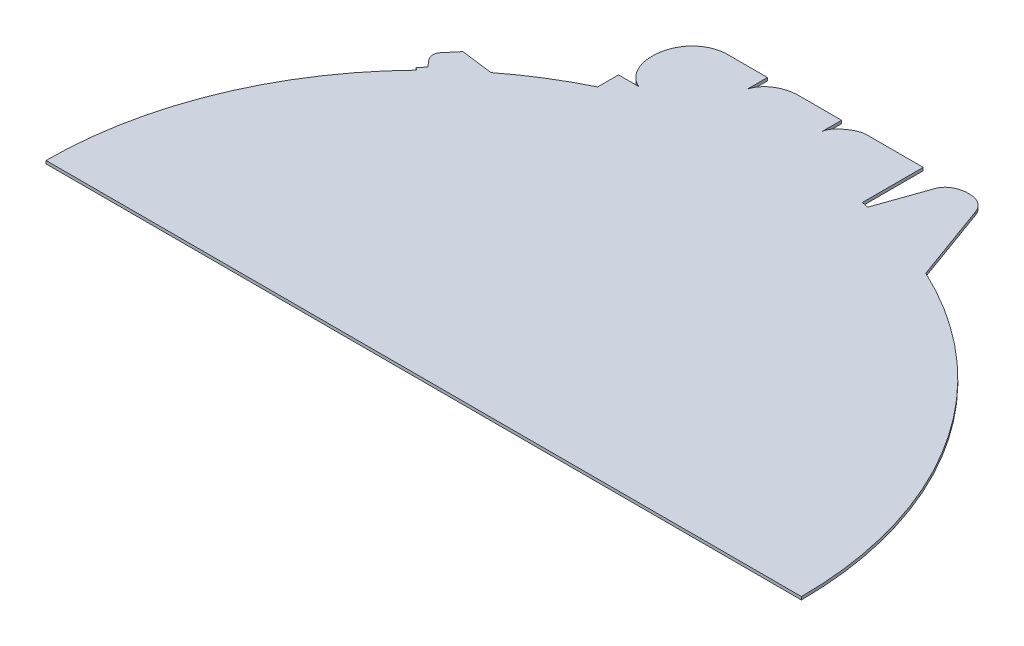
ISO-10303-21;
HEADER;
FILE_DESCRIPTION(('STEP AP214'),'2;1');
FILE_NAME('part.step','',(''),(''),'','','');
FILE_SCHEMA(('AUTOMOTIVE_DESIGN { 1 0 10303 214 1 1 1 1 }'));
ENDSEC;
DATA;
#1=APPLICATION_CONTEXT('core data for automotive mechanical design processes');
#2=APPLICATION_PROTOCOL_DEFINITION('international standard','automotive_design',2000,#1);
#3=PRODUCT_CONTEXT('',#1,'mechanical');
#4=PRODUCT('Part','Part','',(#3));
#5=PRODUCT_RELATED_PRODUCT_CATEGORY('part','',(#4));
#6=PRODUCT_DEFINITION_FORMATION('','',#4);
#7=PRODUCT_DEFINITION_CONTEXT('part definition',#1,'design');
#8=PRODUCT_DEFINITION('design','',#6,#7);
#9=PRODUCT_DEFINITION_SHAPE('','',#8);
#10=(LENGTH_UNIT() NAMED_UNIT(*) SI_UNIT(.MILLI.,.METRE.));
#11=(NAMED_UNIT(*) PLANE_ANGLE_UNIT() SI_UNIT($,.RADIAN.));
#12=(NAMED_UNIT(*) SI_UNIT($,.STERADIAN.) SOLID_ANGLE_UNIT());
#13=UNCERTAINTY_MEASURE_WITH_UNIT(LENGTH_MEASURE(1.E-05),#10,'distance_accuracy_value','');
#14=(GEOMETRIC_REPRESENTATION_CONTEXT(3) GLOBAL_UNCERTAINTY_ASSIGNED_CONTEXT((#13)) GLOBAL_UNIT_ASSIGNED_CONTEXT((#10,
#11,#12)) REPRESENTATION_CONTEXT('',''));
#15=CARTESIAN_POINT('',(0.,0.,0.));
#16=DIRECTION('',(0.,0.,1.));
#17=DIRECTION('',(1.,0.,0.));
#18=AXIS2_PLACEMENT_3D('',#15,#16,#17);
#19=CARTESIAN_POINT('',(61.2417983531615,2.,-137.079482633187));
#20=CARTESIAN_POINT('',(63.470508701976,2.,-142.966505442115));
#21=CARTESIAN_POINT('',(70.6396262263932,2.,-145.565487584388));
#22=CARTESIAN_POINT('',(76.4978494080845,2.,-145.094502844673));
#23=B_SPLINE_CURVE_WITH_KNOTS('',3,(#19,#20,#21,#22),.UNSPECIFIED.,.F.,.F.,(4,4),(0.,1.),.UNSPECIFIED.);
#24=DIRECTION('',(0.,-1.,0.));
#25=VECTOR('',#24,1.);
#26=SURFACE_OF_LINEAR_EXTRUSION('',#23,#25);
#27=CARTESIAN_POINT('',(61.2417983531615,0.,-137.079482633187));
#28=CARTESIAN_POINT('',(63.470508701976,0.,-142.966505442115));
#29=CARTESIAN_POINT('',(70.6396262263932,0.,-145.565487584388));
#30=CARTESIAN_POINT('',(76.4978494080845,0.,-145.094502844673));
#31=B_SPLINE_CURVE_WITH_KNOTS('',3,(#27,#28,#29,#30),.UNSPECIFIED.,.F.,.F.,(4,4),(0.,1.),.UNSPECIFIED.);
#32=CARTESIAN_POINT('',(61.2417983531615,0.,-137.079482633187));
#33=VERTEX_POINT('',#32);
#34=CARTESIAN_POINT('',(73.732714296106,0.,-145.093801448274));
#35=VERTEX_POINT('',#34);
#36=EDGE_CURVE('E242',#33,#35,#31,.T.);
#37=ORIENTED_EDGE('',*,*,#36,.F.);
#38=DIRECTION('',(0.,-1.,0.));
#39=VECTOR('',#38,1.);
#40=CARTESIAN_POINT('',(61.2417983531615,2.,-137.079482633187));
#41=LINE('',#40,#39);
#42=CARTESIAN_POINT('',(61.2417983531615,2.,-137.079482633187));
#43=VERTEX_POINT('',#42);
#44=EDGE_CURVE('E11',#43,#33,#41,.T.);
#45=ORIENTED_EDGE('',*,*,#44,.F.);
#46=CARTESIAN_POINT('',(73.732714296106,2.,-145.093801448274));
#47=VERTEX_POINT('',#46);
#48=EDGE_CURVE('E338',#43,#47,#23,.T.);
#49=ORIENTED_EDGE('',*,*,#48,.T.);
#50=DIRECTION('',(0.,-1.,0.));
#51=VECTOR('',#50,1.);
#52=CARTESIAN_POINT('',(73.732714296106,2.,-145.093801448274));
#53=LINE('',#52,#51);
#54=EDGE_CURVE('E52',#47,#35,#53,.T.);
#55=ORIENTED_EDGE('',*,*,#54,.T.);
#56=EDGE_LOOP('',(#37,#45,#49,#55));
#57=FACE_BOUND('',#56,.T.);
#58=ADVANCED_FACE('F35',(#57),#26,.T.);
#59=CARTESIAN_POINT('',(11.6282593706701,2.,4.08680506508995));
#60=DIRECTION('',(-0.943429676553875,0.,-0.331572684938689));
#61=DIRECTION('',(-0.331572684938689,0.,0.943429676553875));
#62=AXIS2_PLACEMENT_3D('',#59,#60,#61);
#63=PLANE('',#62);
#64=DIRECTION('',(0.331572684938689,0.,-0.943429676553875));
#65=VECTOR('',#64,1.);
#66=CARTESIAN_POINT('',(11.6282593706701,0.,4.08680506508995));
#67=LINE('',#66,#65);
#68=CARTESIAN_POINT('',(49.4033169258323,0.,-103.395240199467));
#69=VERTEX_POINT('',#68);
#70=EDGE_CURVE('E246',#69,#33,#67,.T.);
#71=ORIENTED_EDGE('',*,*,#70,.F.);
#72=DIRECTION('',(0.,-1.,0.));
#73=VECTOR('',#72,1.);
#74=CARTESIAN_POINT('',(49.4033169258323,2.,-103.395240199467));
#75=LINE('',#74,#73);
#76=CARTESIAN_POINT('',(49.4033169258323,2.,-103.395240199467));
#77=VERTEX_POINT('',#76);
#78=EDGE_CURVE('E44',#77,#69,#75,.T.);
#79=ORIENTED_EDGE('',*,*,#78,.F.);
#80=DIRECTION('',(0.331572684938689,0.,-0.943429676553875));
#81=VECTOR('',#80,1.);
#82=CARTESIAN_POINT('',(11.6282593706701,2.,4.08680506508995));
#83=LINE('',#82,#81);
#84=EDGE_CURVE('E406',#77,#43,#83,.T.);
#85=ORIENTED_EDGE('',*,*,#84,.T.);
#86=ORIENTED_EDGE('',*,*,#44,.T.);
#87=EDGE_LOOP('',(#71,#79,#85,#86));
#88=FACE_BOUND('',#87,.T.);
#89=ADVANCED_FACE('F394',(#88),#63,.T.);
#90=CARTESIAN_POINT('',(-0.00210082559104485,2.,145.041993281075));
#91=DIRECTION('',(0.,-1.,0.));
#92=DIRECTION('',(0.,0.,-1.));
#93=AXIS2_PLACEMENT_3D('',#90,#91,#92);
#94=CYLINDRICAL_SURFACE('',#93,253.302100825591);
#95=CARTESIAN_POINT('',(-0.00210082559104485,0.,145.041993281075));
#96=DIRECTION('',(0.,1.,0.));
#97=DIRECTION('',(0.,0.,1.));
#98=AXIS2_PLACEMENT_3D('',#95,#96,#97);
#99=CIRCLE('',#98,253.302100825591);
#100=CARTESIAN_POINT('',(44.8660371290695,0.,-104.254626188864));
#101=VERTEX_POINT('',#100);
#102=EDGE_CURVE('E252',#101,#69,#99,.F.);
#103=ORIENTED_EDGE('',*,*,#102,.F.);
#104=DIRECTION('',(0.,-1.,0.));
#105=VECTOR('',#104,1.);
#106=CARTESIAN_POINT('',(44.8660371290695,2.,-104.254626188864));
#107=LINE('',#106,#105);
#108=CARTESIAN_POINT('',(44.8660371290695,2.,-104.254626188864));
#109=VERTEX_POINT('',#108);
#110=EDGE_CURVE('E383',#109,#101,#107,.T.);
#111=ORIENTED_EDGE('',*,*,#110,.F.);
#112=CARTESIAN_POINT('',(-0.00210082559104485,2.,145.041993281075));
#113=DIRECTION('',(0.,1.,0.));
#114=DIRECTION('',(0.,0.,1.));
#115=AXIS2_PLACEMENT_3D('',#112,#113,#114);
#116=CIRCLE('',#115,253.302100825591);
#117=EDGE_CURVE('E390',#109,#77,#116,.F.);
#118=ORIENTED_EDGE('',*,*,#117,.T.);
#119=ORIENTED_EDGE('',*,*,#78,.T.);
#120=EDGE_LOOP('',(#103,#111,#118,#119));
#121=FACE_BOUND('',#120,.T.);
#122=ADVANCED_FACE('F388',(#121),#94,.T.);
#123=CARTESIAN_POINT('',(44.8660371290696,2.,0.));
#124=DIRECTION('',(1.,0.,0.));
#125=DIRECTION('',(0.,0.,-1.));
#126=AXIS2_PLACEMENT_3D('',#123,#124,#125);
#127=PLANE('',#126);
#128=DIRECTION('',(0.,0.,1.));
#129=VECTOR('',#128,1.);
#130=CARTESIAN_POINT('',(44.8660371290696,0.,0.));
#131=LINE('',#130,#129);
#132=CARTESIAN_POINT('',(44.8660371290695,0.,-145.086479208089));
#133=VERTEX_POINT('',#132);
#134=EDGE_CURVE('E255',#133,#101,#131,.T.);
#135=ORIENTED_EDGE('',*,*,#134,.F.);
#136=DIRECTION('',(0.,-1.,0.));
#137=VECTOR('',#136,1.);
#138=CARTESIAN_POINT('',(44.8660371290695,2.,-145.086479208089));
#139=LINE('',#138,#137);
#140=CARTESIAN_POINT('',(44.8660371290695,2.,-145.086479208089));
#141=VERTEX_POINT('',#140);
#142=EDGE_CURVE('E381',#141,#133,#139,.T.);
#143=ORIENTED_EDGE('',*,*,#142,.F.);
#144=DIRECTION('',(0.,0.,1.));
#145=VECTOR('',#144,1.);
#146=CARTESIAN_POINT('',(44.8660371290696,2.,0.));
#147=LINE('',#146,#145);
#148=EDGE_CURVE('E403',#141,#109,#147,.T.);
#149=ORIENTED_EDGE('',*,*,#148,.T.);
#150=ORIENTED_EDGE('',*,*,#110,.T.);
#151=EDGE_LOOP('',(#135,#143,#149,#150));
#152=FACE_BOUND('',#151,.T.);
#153=ADVANCED_FACE('F400',(#152),#127,.T.);
#154=CARTESIAN_POINT('',(-0.0367993393330851,2.,-145.075089280815));
#155=DIRECTION('',(-0.000253657180785761,0.,-0.999999967829017));
#156=DIRECTION('',(-0.999999967829017,0.,0.000253657180785761));
#157=AXIS2_PLACEMENT_3D('',#154,#155,#156);
#158=PLANE('',#157);
#159=DIRECTION('',(0.999999967829017,0.,-0.000253657180785761));
#160=VECTOR('',#159,1.);
#161=CARTESIAN_POINT('',(-0.0367993393330851,0.,-145.075089280815));
#162=LINE('',#161,#160);
#163=CARTESIAN_POINT('',(6.40048037634305,0.,-145.076722143092));
#164=VERTEX_POINT('',#163);
#165=EDGE_CURVE('E258',#164,#133,#162,.T.);
#166=ORIENTED_EDGE('',*,*,#165,.F.);
#167=DIRECTION('',(0.,-1.,0.));
#168=VECTOR('',#167,1.);
#169=CARTESIAN_POINT('',(6.40048037634305,2.,-145.076722143092));
#170=LINE('',#169,#168);
#171=CARTESIAN_POINT('',(6.40048037634305,2.,-145.076722143092));
#172=VERTEX_POINT('',#171);
#173=EDGE_CURVE('E379',#172,#164,#170,.T.);
#174=ORIENTED_EDGE('',*,*,#173,.F.);
#175=DIRECTION('',(0.999999967829017,0.,-0.000253657180785761));
#176=VECTOR('',#175,1.);
#177=CARTESIAN_POINT('',(-0.0367993393330851,2.,-145.075089280815));
#178=LINE('',#177,#176);
#179=EDGE_CURVE('E408',#172,#141,#178,.T.);
#180=ORIENTED_EDGE('',*,*,#179,.T.);
#181=ORIENTED_EDGE('',*,*,#142,.T.);
#182=EDGE_LOOP('',(#166,#174,#180,#181));
#183=FACE_BOUND('',#182,.T.);
#184=ADVANCED_FACE('F430',(#183),#158,.T.);
#185=CARTESIAN_POINT('',(-9.85979738904993,2.,-131.748243103197));
#186=CARTESIAN_POINT('',(-9.46878569829964,2.,-135.744179635625));
#187=CARTESIAN_POINT('',(-3.54267183959884,2.,-141.546381179234));
#188=CARTESIAN_POINT('',(3.54888228833849,2.,-145.399596001504));
#189=CARTESIAN_POINT('',(8.33549724564113,2.,-145.077212974032));
#190=B_SPLINE_CURVE_WITH_KNOTS('',3,(#185,#186,#187,#188,#189),.UNSPECIFIED.,.F.,.F.,(4,1,4),
(0.,0.454488203103129,1.),.UNSPECIFIED.);
#191=DIRECTION('',(0.,-1.,0.));
#192=VECTOR('',#191,1.);
#193=SURFACE_OF_LINEAR_EXTRUSION('',#190,#192);
#194=CARTESIAN_POINT('',(-9.85979738904993,0.,-131.748243103197));
#195=CARTESIAN_POINT('',(-9.46878569829964,0.,-135.744179635625));
#196=CARTESIAN_POINT('',(-3.54267183959884,0.,-141.546381179234));
#197=CARTESIAN_POINT('',(3.54888228833849,0.,-145.399596001504));
#198=CARTESIAN_POINT('',(8.33549724564113,0.,-145.077212974032));
#199=B_SPLINE_CURVE_WITH_KNOTS('',3,(#194,#195,#196,#197,#198),.UNSPECIFIED.,.F.,.F.,(4,1,4),
(0.,0.454488203103129,1.),.UNSPECIFIED.);
#200=CARTESIAN_POINT('',(-9.85979738904993,0.,-131.748243103197));
#201=VERTEX_POINT('',#200);
#202=EDGE_CURVE('E261',#201,#164,#199,.T.);
#203=ORIENTED_EDGE('',*,*,#202,.F.);
#204=DIRECTION('',(0.,-1.,0.));
#205=VECTOR('',#204,1.);
#206=CARTESIAN_POINT('',(-9.85979738904993,2.,-131.748243103197));
#207=LINE('',#206,#205);
#208=CARTESIAN_POINT('',(-9.85979738904993,2.,-131.748243103197));
#209=VERTEX_POINT('',#208);
#210=EDGE_CURVE('E377',#209,#201,#207,.T.);
#211=ORIENTED_EDGE('',*,*,#210,.F.);
#212=EDGE_CURVE('E413',#209,#172,#190,.T.);
#213=ORIENTED_EDGE('',*,*,#212,.T.);
#214=ORIENTED_EDGE('',*,*,#173,.T.);
#215=EDGE_LOOP('',(#203,#211,#213,#214));
#216=FACE_BOUND('',#215,.T.);
#217=ADVANCED_FACE('F425',(#216),#193,.T.);
#218=CARTESIAN_POINT('',(-9.85979738904993,2.,0.));
#219=DIRECTION('',(-1.,0.,0.));
#220=DIRECTION('',(0.,0.,1.));
#221=AXIS2_PLACEMENT_3D('',#218,#219,#220);
#222=PLANE('',#221);
#223=DIRECTION('',(0.,0.,-1.));
#224=VECTOR('',#223,1.);
#225=CARTESIAN_POINT('',(-9.85979738904993,0.,0.));
#226=LINE('',#225,#224);
#227=CARTESIAN_POINT('',(-9.85979738904993,0.,-145.072597606743));
#228=VERTEX_POINT('',#227);
#229=EDGE_CURVE('E266',#201,#228,#226,.T.);
#230=ORIENTED_EDGE('',*,*,#229,.T.);
#231=DIRECTION('',(0.,-1.,0.));
#232=VECTOR('',#231,1.);
#233=CARTESIAN_POINT('',(-9.85979738904993,2.,-145.072597606743));
#234=LINE('',#233,#232);
#235=CARTESIAN_POINT('',(-9.85979738904993,2.,-145.072597606743));
#236=VERTEX_POINT('',#235);
#237=EDGE_CURVE('E375',#236,#228,#234,.T.);
#238=ORIENTED_EDGE('',*,*,#237,.F.);
#239=DIRECTION('',(0.,0.,-1.));
#240=VECTOR('',#239,1.);
#241=CARTESIAN_POINT('',(-9.85979738904993,2.,0.));
#242=LINE('',#241,#240);
#243=EDGE_CURVE('E419',#209,#236,#242,.T.);
#244=ORIENTED_EDGE('',*,*,#243,.F.);
#245=ORIENTED_EDGE('',*,*,#210,.T.);
#246=EDGE_LOOP('',(#230,#238,#244,#245));
#247=FACE_BOUND('',#246,.T.);
#248=ADVANCED_FACE('F429',(#247),#222,.F.);
#249=CARTESIAN_POINT('',(-0.0367993393330721,2.,-145.075089280815));
#250=DIRECTION('',(-0.000253657180785672,0.,-0.999999967829017));
#251=DIRECTION('',(-0.999999967829017,0.,0.000253657180785672));
#252=AXIS2_PLACEMENT_3D('',#249,#250,#251);
#253=PLANE('',#252);
#254=DIRECTION('',(0.999999967829017,0.,-0.000253657180785672));
#255=VECTOR('',#254,1.);
#256=CARTESIAN_POINT('',(-0.0367993393330721,0.,-145.075089280815));
#257=LINE('',#256,#255);
#258=CARTESIAN_POINT('',(-38.8587765101108,0.,-145.065241807216));
#259=VERTEX_POINT('',#258);
#260=EDGE_CURVE('E272',#259,#228,#257,.T.);
#261=ORIENTED_EDGE('',*,*,#260,.F.);
#262=DIRECTION('',(0.,-1.,0.));
#263=VECTOR('',#262,1.);
#264=CARTESIAN_POINT('',(-38.8587765101108,2.,-145.065241807216));
#265=LINE('',#264,#263);
#266=CARTESIAN_POINT('',(-38.8587765101108,2.,-145.065241807216));
#267=VERTEX_POINT('',#266);
#268=EDGE_CURVE('E373',#267,#259,#265,.T.);
#269=ORIENTED_EDGE('',*,*,#268,.F.);
#270=DIRECTION('',(0.999999967829017,0.,-0.000253657180785672));
#271=VECTOR('',#270,1.);
#272=CARTESIAN_POINT('',(-0.0367993393330721,2.,-145.075089280815));
#273=LINE('',#272,#271);
#274=EDGE_CURVE('E605',#267,#236,#273,.T.);
#275=ORIENTED_EDGE('',*,*,#274,.T.);
#276=ORIENTED_EDGE('',*,*,#237,.T.);
#277=EDGE_LOOP('',(#261,#269,#275,#276));
#278=FACE_BOUND('',#277,.T.);
#279=ADVANCED_FACE('F601',(#278),#253,.T.);
#280=CARTESIAN_POINT('',(-59.5469420149884,2.,-131.748243103197));
#281=CARTESIAN_POINT('',(-56.872959994893,2.,-140.401818923131));
#282=CARTESIAN_POINT('',(-47.4285834680343,2.,-145.063068014074));
#283=CARTESIAN_POINT('',(-38.8587765101108,2.,-145.065241807216));
#284=B_SPLINE_CURVE_WITH_KNOTS('',3,(#280,#281,#282,#283),.UNSPECIFIED.,.F.,.F.,(4,4),(0.,1.),.UNSPECIFIED.);
#285=DIRECTION('',(0.,-1.,0.));
#286=VECTOR('',#285,1.);
#287=SURFACE_OF_LINEAR_EXTRUSION('',#284,#286);
#288=CARTESIAN_POINT('',(-59.5469420149884,0.,-131.748243103197));
#289=CARTESIAN_POINT('',(-56.872959994893,0.,-140.401818923131));
#290=CARTESIAN_POINT('',(-47.4285834680343,0.,-145.063068014074));
#291=CARTESIAN_POINT('',(-38.8587765101108,0.,-145.065241807216));
#292=B_SPLINE_CURVE_WITH_KNOTS('',3,(#288,#289,#290,#291),.UNSPECIFIED.,.F.,.F.,(4,4),(0.,1.),.UNSPECIFIED.);
#293=CARTESIAN_POINT('',(-59.5469420149884,0.,-131.748243103197));
#294=VERTEX_POINT('',#293);
#295=EDGE_CURVE('E275',#294,#259,#292,.T.);
#296=ORIENTED_EDGE('',*,*,#295,.F.);
#297=DIRECTION('',(0.,-1.,0.));
#298=VECTOR('',#297,1.);
#299=CARTESIAN_POINT('',(-59.5469420149884,2.,-131.748243103197));
#300=LINE('',#299,#298);
#301=CARTESIAN_POINT('',(-59.5469420149884,2.,-131.748243103197));
#302=VERTEX_POINT('',#301);
#303=EDGE_CURVE('E371',#302,#294,#300,.T.);
#304=ORIENTED_EDGE('',*,*,#303,.F.);
#305=EDGE_CURVE('E609',#302,#267,#284,.T.);
#306=ORIENTED_EDGE('',*,*,#305,.T.);
#307=ORIENTED_EDGE('',*,*,#268,.T.);
#308=EDGE_LOOP('',(#296,#304,#306,#307));
#309=FACE_BOUND('',#308,.T.);
#310=ADVANCED_FACE('F596',(#309),#287,.T.);
#311=CARTESIAN_POINT('',(-59.5469420149884,2.,0.));
#312=DIRECTION('',(1.,0.,0.));
#313=DIRECTION('',(0.,0.,-1.));
#314=AXIS2_PLACEMENT_3D('',#311,#312,#313);
#315=PLANE('',#314);
#316=DIRECTION('',(0.,0.,1.));
#317=VECTOR('',#316,1.);
#318=CARTESIAN_POINT('',(-59.5469420149884,0.,0.));
#319=LINE('',#318,#317);
#320=CARTESIAN_POINT('',(-59.5469420149884,0.,-145.05999410531));
#321=VERTEX_POINT('',#320);
#322=EDGE_CURVE('E280',#321,#294,#319,.T.);
#323=ORIENTED_EDGE('',*,*,#322,.F.);
#324=DIRECTION('',(0.,-1.,0.));
#325=VECTOR('',#324,1.);
#326=CARTESIAN_POINT('',(-59.5469420149884,2.,-145.05999410531));
#327=LINE('',#326,#325);
#328=CARTESIAN_POINT('',(-59.5469420149884,2.,-145.05999410531));
#329=VERTEX_POINT('',#328);
#330=EDGE_CURVE('E369',#329,#321,#327,.T.);
#331=ORIENTED_EDGE('',*,*,#330,.F.);
#332=DIRECTION('',(0.,0.,1.));
#333=VECTOR('',#332,1.);
#334=CARTESIAN_POINT('',(-59.5469420149884,2.,0.));
#335=LINE('',#334,#333);
#336=EDGE_CURVE('E592',#329,#302,#335,.T.);
#337=ORIENTED_EDGE('',*,*,#336,.T.);
#338=ORIENTED_EDGE('',*,*,#303,.T.);
#339=EDGE_LOOP('',(#323,#331,#337,#338));
#340=FACE_BOUND('',#339,.T.);
#341=ADVANCED_FACE('F590',(#340),#315,.T.);
#342=CARTESIAN_POINT('',(-0.0367993393329208,2.,-145.075089280815));
#343=DIRECTION('',(-0.000253657180784629,0.,-0.999999967829017));
#344=DIRECTION('',(-0.999999967829017,0.,0.000253657180784629));
#345=AXIS2_PLACEMENT_3D('',#342,#343,#344);
#346=PLANE('',#345);
#347=DIRECTION('',(0.999999967829017,0.,-0.000253657180784629));
#348=VECTOR('',#347,1.);
#349=CARTESIAN_POINT('',(-0.0367993393329208,0.,-145.075089280815));
#350=LINE('',#349,#348);
#351=CARTESIAN_POINT('',(-87.5397634333962,0.,-145.052893524918));
#352=VERTEX_POINT('',#351);
#353=EDGE_CURVE('E286',#352,#321,#350,.T.);
#354=ORIENTED_EDGE('',*,*,#353,.F.);
#355=DIRECTION('',(0.,-1.,0.));
#356=VECTOR('',#355,1.);
#357=CARTESIAN_POINT('',(-87.5397634333962,2.,-145.052893524918));
#358=LINE('',#357,#356);
#359=CARTESIAN_POINT('',(-87.5397634333962,2.,-145.052893524918));
#360=VERTEX_POINT('',#359);
#361=EDGE_CURVE('E367',#360,#352,#358,.T.);
#362=ORIENTED_EDGE('',*,*,#361,.F.);
#363=DIRECTION('',(0.999999967829017,0.,-0.000253657180784629));
#364=VECTOR('',#363,1.);
#365=CARTESIAN_POINT('',(-0.0367993393329208,2.,-145.075089280815));
#366=LINE('',#365,#364);
#367=EDGE_CURVE('E521',#360,#329,#366,.T.);
#368=ORIENTED_EDGE('',*,*,#367,.T.);
#369=ORIENTED_EDGE('',*,*,#330,.T.);
#370=EDGE_LOOP('',(#354,#362,#368,#369));
#371=FACE_BOUND('',#370,.T.);
#372=ADVANCED_FACE('F510',(#371),#346,.T.);
#373=CARTESIAN_POINT('',(-97.5008645354893,2.,-96.6299527719679));
#374=CARTESIAN_POINT('',(-104.579533847672,2.,-99.8593727877397));
#375=CARTESIAN_POINT('',(-116.831393377355,2.,-118.836705983146));
#376=CARTESIAN_POINT('',(-105.084694212164,2.,-143.726198357298));
#377=CARTESIAN_POINT('',(-87.5397634333962,2.,-145.052893524918));
#378=B_SPLINE_CURVE_WITH_KNOTS('',3,(#373,#374,#375,#376,#377),.UNSPECIFIED.,.F.,.F.,(4,1,4),
(0.,0.332503247600542,1.),.UNSPECIFIED.);
#379=DIRECTION('',(0.,-1.,0.));
#380=VECTOR('',#379,1.);
#381=SURFACE_OF_LINEAR_EXTRUSION('',#378,#380);
#382=CARTESIAN_POINT('',(-97.5008645354893,0.,-96.6299527719679));
#383=CARTESIAN_POINT('',(-104.579533847672,0.,-99.8593727877397));
#384=CARTESIAN_POINT('',(-116.831393377355,0.,-118.836705983146));
#385=CARTESIAN_POINT('',(-105.084694212164,0.,-143.726198357298));
#386=CARTESIAN_POINT('',(-87.5397634333962,0.,-145.052893524918));
#387=B_SPLINE_CURVE_WITH_KNOTS('',3,(#382,#383,#384,#385,#386),.UNSPECIFIED.,.F.,.F.,(4,1,4),
(0.,0.332503247600542,1.),.UNSPECIFIED.);
#388=CARTESIAN_POINT('',(-97.5008645354893,0.,-96.6299527719679));
#389=VERTEX_POINT('',#388);
#390=EDGE_CURVE('E289',#389,#352,#387,.T.);
#391=ORIENTED_EDGE('',*,*,#390,.F.);
#392=DIRECTION('',(0.,-1.,0.));
#393=VECTOR('',#392,1.);
#394=CARTESIAN_POINT('',(-97.5008645354893,2.,-96.6299527719679));
#395=LINE('',#394,#393);
#396=CARTESIAN_POINT('',(-97.5008645354893,2.,-96.6299527719679));
#397=VERTEX_POINT('',#396);
#398=EDGE_CURVE('E365',#397,#389,#395,.T.);
#399=ORIENTED_EDGE('',*,*,#398,.F.);
#400=EDGE_CURVE('E513',#397,#360,#378,.T.);
#401=ORIENTED_EDGE('',*,*,#400,.T.);
#402=ORIENTED_EDGE('',*,*,#361,.T.);
#403=EDGE_LOOP('',(#391,#399,#401,#402));
#404=FACE_BOUND('',#403,.T.);
#405=ADVANCED_FACE('F505',(#404),#381,.T.);
#406=CARTESIAN_POINT('',(0.,2.,-96.6299527719679));
#407=DIRECTION('',(0.,0.,-1.));
#408=DIRECTION('',(-1.,0.,0.));
#409=AXIS2_PLACEMENT_3D('',#406,#407,#408);
#410=PLANE('',#409);
#411=DIRECTION('',(1.,0.,0.));
#412=VECTOR('',#411,1.);
#413=CARTESIAN_POINT('',(0.,0.,-96.6299527719679));
#414=LINE('',#413,#412);
#415=CARTESIAN_POINT('',(-111.014713035624,0.,-96.6299527719679));
#416=VERTEX_POINT('',#415);
#417=EDGE_CURVE('E294',#416,#389,#414,.T.);
#418=ORIENTED_EDGE('',*,*,#417,.F.);
#419=DIRECTION('',(0.,-1.,0.));
#420=VECTOR('',#419,1.);
#421=CARTESIAN_POINT('',(-111.014713035624,2.,-96.6299527719679));
#422=LINE('',#421,#420);
#423=CARTESIAN_POINT('',(-111.014713035624,2.,-96.6299527719679));
#424=VERTEX_POINT('',#423);
#425=EDGE_CURVE('E363',#424,#416,#422,.T.);
#426=ORIENTED_EDGE('',*,*,#425,.F.);
#427=DIRECTION('',(1.,0.,0.));
#428=VECTOR('',#427,1.);
#429=CARTESIAN_POINT('',(0.,2.,-96.6299527719679));
#430=LINE('',#429,#428);
#431=EDGE_CURVE('E520',#424,#397,#430,.T.);
#432=ORIENTED_EDGE('',*,*,#431,.T.);
#433=ORIENTED_EDGE('',*,*,#398,.T.);
#434=EDGE_LOOP('',(#418,#426,#432,#433));
#435=FACE_BOUND('',#434,.T.);
#436=ADVANCED_FACE('F501',(#435),#410,.T.);
#437=CARTESIAN_POINT('',(-111.014713035624,2.,0.));
#438=DIRECTION('',(-1.,0.,0.));
#439=DIRECTION('',(0.,0.,1.));
#440=AXIS2_PLACEMENT_3D('',#437,#438,#439);
#441=PLANE('',#440);
#442=DIRECTION('',(0.,0.,-1.));
#443=VECTOR('',#442,1.);
#444=CARTESIAN_POINT('',(-111.014713035624,0.,0.));
#445=LINE('',#444,#443);
#446=CARTESIAN_POINT('',(-111.014713035624,0.,-82.6379448183603));
#447=VERTEX_POINT('',#446);
#448=EDGE_CURVE('E300',#447,#416,#445,.T.);
#449=ORIENTED_EDGE('',*,*,#448,.F.);
#450=DIRECTION('',(0.,-1.,0.));
#451=VECTOR('',#450,1.);
#452=CARTESIAN_POINT('',(-111.014713035624,2.,-82.6379448183603));
#453=LINE('',#452,#451);
#454=CARTESIAN_POINT('',(-111.014713035624,2.,-82.6379448183603));
#455=VERTEX_POINT('',#454);
#456=EDGE_CURVE('E361',#455,#447,#453,.T.);
#457=ORIENTED_EDGE('',*,*,#456,.F.);
#458=DIRECTION('',(0.,0.,-1.));
#459=VECTOR('',#458,1.);
#460=CARTESIAN_POINT('',(-111.014713035624,2.,0.));
#461=LINE('',#460,#459);
#462=EDGE_CURVE('E528',#455,#424,#461,.T.);
#463=ORIENTED_EDGE('',*,*,#462,.T.);
#464=ORIENTED_EDGE('',*,*,#425,.T.);
#465=EDGE_LOOP('',(#449,#457,#463,#464));
#466=FACE_BOUND('',#465,.T.);
#467=ADVANCED_FACE('F497',(#466),#441,.T.);
#468=CARTESIAN_POINT('',(-0.00210082559104485,2.,145.041993281075));
#469=DIRECTION('',(0.,-1.,0.));
#470=DIRECTION('',(0.,0.,-1.));
#471=AXIS2_PLACEMENT_3D('',#468,#469,#470);
#472=CYLINDRICAL_SURFACE('',#471,253.302100825591);
#473=CARTESIAN_POINT('',(-0.00210082559104485,0.,145.041993281075));
#474=DIRECTION('',(0.,1.,0.));
#475=DIRECTION('',(0.,0.,1.));
#476=AXIS2_PLACEMENT_3D('',#473,#474,#475);
#477=CIRCLE('',#476,253.302100825591);
#478=CARTESIAN_POINT('',(-155.12158138055,0.,-55.2076035600109));
#479=VERTEX_POINT('',#478);
#480=EDGE_CURVE('E303',#479,#447,#477,.F.);
#481=ORIENTED_EDGE('',*,*,#480,.F.);
#482=DIRECTION('',(0.,-1.,0.));
#483=VECTOR('',#482,1.);
#484=CARTESIAN_POINT('',(-155.12158138055,2.,-55.2076035600109));
#485=LINE('',#484,#483);
#486=CARTESIAN_POINT('',(-155.12158138055,2.,-55.2076035600109));
#487=VERTEX_POINT('',#486);
#488=EDGE_CURVE('E359',#487,#479,#485,.T.);
#489=ORIENTED_EDGE('',*,*,#488,.F.);
#490=CARTESIAN_POINT('',(-0.00210082559104485,2.,145.041993281075));
#491=DIRECTION('',(0.,1.,0.));
#492=DIRECTION('',(0.,0.,1.));
#493=AXIS2_PLACEMENT_3D('',#490,#491,#492);
#494=CIRCLE('',#493,253.302100825591);
#495=EDGE_CURVE('E531',#487,#455,#494,.F.);
#496=ORIENTED_EDGE('',*,*,#495,.T.);
#497=ORIENTED_EDGE('',*,*,#456,.T.);
#498=EDGE_LOOP('',(#481,#489,#496,#497));
#499=FACE_BOUND('',#498,.T.);
#500=ADVANCED_FACE('F493',(#499),#472,.T.);
#501=CARTESIAN_POINT('',(4.4846157448479,2.,-34.4006693015903));
#502=DIRECTION('',(-0.129270364558562,0.,0.991609385215215));
#503=DIRECTION('',(0.991609385215215,0.,0.129270364558562));
#504=AXIS2_PLACEMENT_3D('',#501,#502,#503);
#505=PLANE('',#504);
#506=DIRECTION('',(-0.991609385215215,0.,-0.129270364558562));
#507=VECTOR('',#506,1.);
#508=CARTESIAN_POINT('',(4.4846157448479,0.,-34.4006693015903));
#509=LINE('',#508,#507);
#510=CARTESIAN_POINT('',(-176.684435440456,0.,-58.0186277866948));
#511=VERTEX_POINT('',#510);
#512=EDGE_CURVE('E306',#479,#511,#509,.T.);
#513=ORIENTED_EDGE('',*,*,#512,.T.);
#514=DIRECTION('',(0.,-1.,0.));
#515=VECTOR('',#514,1.);
#516=CARTESIAN_POINT('',(-176.684435440456,2.,-58.0186277866948));
#517=LINE('',#516,#515);
#518=CARTESIAN_POINT('',(-176.684435440456,2.,-58.0186277866948));
#519=VERTEX_POINT('',#518);
#520=EDGE_CURVE('E356',#519,#511,#517,.T.);
#521=ORIENTED_EDGE('',*,*,#520,.F.);
#522=DIRECTION('',(-0.991609385215215,0.,-0.129270364558562));
#523=VECTOR('',#522,1.);
#524=CARTESIAN_POINT('',(4.4846157448479,2.,-34.4006693015903));
#525=LINE('',#524,#523);
#526=EDGE_CURVE('E534',#487,#519,#525,.T.);
#527=ORIENTED_EDGE('',*,*,#526,.F.);
#528=ORIENTED_EDGE('',*,*,#488,.T.);
#529=EDGE_LOOP('',(#513,#521,#527,#528));
#530=FACE_BOUND('',#529,.T.);
#531=ADVANCED_FACE('F489',(#530),#505,.F.);
#532=CARTESIAN_POINT('',(-132.394917912963,2.,-110.894888508293));
#533=DIRECTION('',(0.7666076493399,0.,0.642115808848803));
#534=DIRECTION('',(0.642115808848803,0.,-0.7666076493399));
#535=AXIS2_PLACEMENT_3D('',#532,#533,#534);
#536=PLANE('',#535);
#537=DIRECTION('',(-0.642115808848803,0.,0.7666076493399));
#538=VECTOR('',#537,1.);
#539=CARTESIAN_POINT('',(-132.394917912963,0.,-110.894888508293));
#540=LINE('',#539,#538);
#541=CARTESIAN_POINT('',(-184.391490566928,0.,-48.8173476867228));
#542=VERTEX_POINT('',#541);
#543=EDGE_CURVE('E308',#511,#542,#540,.T.);
#544=ORIENTED_EDGE('',*,*,#543,.T.);
#545=DIRECTION('',(0.,-1.,0.));
#546=VECTOR('',#545,1.);
#547=CARTESIAN_POINT('',(-184.391490566928,2.,-48.8173476867228));
#548=LINE('',#547,#546);
#549=CARTESIAN_POINT('',(-184.391490566928,2.,-48.8173476867228));
#550=VERTEX_POINT('',#549);
#551=EDGE_CURVE('E354',#550,#542,#548,.T.);
#552=ORIENTED_EDGE('',*,*,#551,.F.);
#553=DIRECTION('',(-0.642115808848803,0.,0.7666076493399));
#554=VECTOR('',#553,1.);
#555=CARTESIAN_POINT('',(-132.394917912963,2.,-110.894888508293));
#556=LINE('',#555,#554);
#557=EDGE_CURVE('E536',#519,#550,#556,.T.);
#558=ORIENTED_EDGE('',*,*,#557,.F.);
#559=ORIENTED_EDGE('',*,*,#520,.T.);
#560=EDGE_LOOP('',(#544,#552,#558,#559));
#561=FACE_BOUND('',#560,.T.);
#562=ADVANCED_FACE('F485',(#561),#536,.F.);
#563=CARTESIAN_POINT('',(-178.095677827288,2.,-46.1437344932152));
#564=DIRECTION('',(0.,-1.,0.));
#565=DIRECTION('',(0.,0.,-1.));
#566=AXIS2_PLACEMENT_3D('',#563,#564,#565);
#567=CYLINDRICAL_SURFACE('',#566,6.83999017258855);
#568=CARTESIAN_POINT('',(-178.095677827288,0.,-46.1437344932152));
#569=DIRECTION('',(0.,1.,0.));
#570=DIRECTION('',(0.,0.,1.));
#571=AXIS2_PLACEMENT_3D('',#568,#569,#570);
#572=CIRCLE('',#571,6.83999017258855);
#573=CARTESIAN_POINT('',(-183.300343727517,0.,-41.7056134461838));
#574=VERTEX_POINT('',#573);
#575=EDGE_CURVE('E311',#574,#542,#572,.F.);
#576=ORIENTED_EDGE('',*,*,#575,.F.);
#577=DIRECTION('',(0.,-1.,0.));
#578=VECTOR('',#577,1.);
#579=CARTESIAN_POINT('',(-183.300343727517,2.,-41.7056134461838));
#580=LINE('',#579,#578);
#581=CARTESIAN_POINT('',(-183.300343727517,2.,-41.7056134461838));
#582=VERTEX_POINT('',#581);
#583=EDGE_CURVE('E352',#582,#574,#580,.T.);
#584=ORIENTED_EDGE('',*,*,#583,.F.);
#585=CARTESIAN_POINT('',(-178.095677827288,2.,-46.1437344932152));
#586=DIRECTION('',(0.,1.,0.));
#587=DIRECTION('',(0.,0.,1.));
#588=AXIS2_PLACEMENT_3D('',#585,#586,#587);
#589=CIRCLE('',#588,6.83999017258855);
#590=EDGE_CURVE('E538',#582,#550,#589,.F.);
#591=ORIENTED_EDGE('',*,*,#590,.T.);
#592=ORIENTED_EDGE('',*,*,#551,.T.);
#593=EDGE_LOOP('',(#576,#584,#591,#592));
#594=FACE_BOUND('',#593,.T.);
#595=ADVANCED_FACE('F481',(#594),#567,.T.);
#596=CARTESIAN_POINT('',(-85.5390579867346,2.,72.9408382538955));
#597=DIRECTION('',(-0.760917160537267,0.,0.648849038528919));
#598=DIRECTION('',(0.648849038528919,0.,0.760917160537267));
#599=AXIS2_PLACEMENT_3D('',#596,#597,#598);
#600=PLANE('',#599);
#601=DIRECTION('',(-0.648849038528919,0.,-0.760917160537267));
#602=VECTOR('',#601,1.);
#603=CARTESIAN_POINT('',(-85.5390579867346,0.,72.9408382538955));
#604=LINE('',#603,#602);
#605=CARTESIAN_POINT('',(-179.406379637585,0.,-37.1390903836502));
#606=VERTEX_POINT('',#605);
#607=EDGE_CURVE('E314',#606,#574,#604,.T.);
#608=ORIENTED_EDGE('',*,*,#607,.F.);
#609=DIRECTION('',(0.,-1.,0.));
#610=VECTOR('',#609,1.);
#611=CARTESIAN_POINT('',(-179.406379637585,2.,-37.1390903836502));
#612=LINE('',#611,#610);
#613=CARTESIAN_POINT('',(-179.406379637585,2.,-37.1390903836502));
#614=VERTEX_POINT('',#613);
#615=EDGE_CURVE('E350',#614,#606,#612,.T.);
#616=ORIENTED_EDGE('',*,*,#615,.F.);
#617=DIRECTION('',(-0.648849038528919,0.,-0.760917160537267));
#618=VECTOR('',#617,1.);
#619=CARTESIAN_POINT('',(-85.5390579867346,2.,72.9408382538955));
#620=LINE('',#619,#618);
#621=EDGE_CURVE('E541',#614,#582,#620,.T.);
#622=ORIENTED_EDGE('',*,*,#621,.T.);
#623=ORIENTED_EDGE('',*,*,#583,.T.);
#624=EDGE_LOOP('',(#608,#616,#622,#623));
#625=FACE_BOUND('',#624,.T.);
#626=ADVANCED_FACE('F477',(#625),#600,.T.);
#627=CARTESIAN_POINT('',(-110.750525490262,2.,-107.723905339998));
#628=DIRECTION('',(-0.716833852025544,0.,-0.697244023703481));
#629=DIRECTION('',(-0.697244023703481,0.,0.716833852025544));
#630=AXIS2_PLACEMENT_3D('',#627,#628,#629);
#631=PLANE('',#630);
#632=DIRECTION('',(0.697244023703481,0.,-0.716833852025544));
#633=VECTOR('',#632,1.);
#634=CARTESIAN_POINT('',(-110.750525490262,0.,-107.723905339998));
#635=LINE('',#634,#633);
#636=CARTESIAN_POINT('',(-183.244712688249,0.,-33.1929151960172));
#637=VERTEX_POINT('',#636);
#638=EDGE_CURVE('E317',#637,#606,#635,.T.);
#639=ORIENTED_EDGE('',*,*,#638,.F.);
#640=DIRECTION('',(0.,-1.,0.));
#641=VECTOR('',#640,1.);
#642=CARTESIAN_POINT('',(-183.244712688249,2.,-33.1929151960172));
#643=LINE('',#642,#641);
#644=CARTESIAN_POINT('',(-183.244712688249,2.,-33.1929151960172));
#645=VERTEX_POINT('',#644);
#646=EDGE_CURVE('E348',#645,#637,#643,.T.);
#647=ORIENTED_EDGE('',*,*,#646,.F.);
#648=DIRECTION('',(0.697244023703481,0.,-0.716833852025544));
#649=VECTOR('',#648,1.);
#650=CARTESIAN_POINT('',(-110.750525490262,2.,-107.723905339998));
#651=LINE('',#650,#649);
#652=EDGE_CURVE('E544',#645,#614,#651,.T.);
#653=ORIENTED_EDGE('',*,*,#652,.T.);
#654=ORIENTED_EDGE('',*,*,#615,.T.);
#655=EDGE_LOOP('',(#639,#647,#653,#654));
#656=FACE_BOUND('',#655,.T.);
#657=ADVANCED_FACE('F473',(#656),#631,.T.);
#658=CARTESIAN_POINT('',(-72.4941871979865,2.,74.5309901439805));
#659=DIRECTION('',(-0.697244023703482,0.,0.716833852025543));
#660=DIRECTION('',(0.716833852025543,0.,0.697244023703482));
#661=AXIS2_PLACEMENT_3D('',#658,#659,#660);
#662=PLANE('',#661);
#663=DIRECTION('',(-0.716833852025543,0.,-0.697244023703482));
#664=VECTOR('',#663,1.);
#665=CARTESIAN_POINT('',(-72.4941871979865,0.,74.5309901439805));
#666=LINE('',#665,#664);
#667=CARTESIAN_POINT('',(-181.577621486562,0.,-31.5713827111046));
#668=VERTEX_POINT('',#667);
#669=EDGE_CURVE('E320',#668,#637,#666,.T.);
#670=ORIENTED_EDGE('',*,*,#669,.F.);
#671=DIRECTION('',(0.,-1.,0.));
#672=VECTOR('',#671,1.);
#673=CARTESIAN_POINT('',(-181.577621486562,2.,-31.5713827111046));
#674=LINE('',#673,#672);
#675=CARTESIAN_POINT('',(-181.577621486562,2.,-31.5713827111046));
#676=VERTEX_POINT('',#675);
#677=EDGE_CURVE('E346',#676,#668,#674,.T.);
#678=ORIENTED_EDGE('',*,*,#677,.F.);
#679=DIRECTION('',(-0.716833852025543,0.,-0.697244023703482));
#680=VECTOR('',#679,1.);
#681=CARTESIAN_POINT('',(-72.4941871979865,2.,74.5309901439805));
#682=LINE('',#681,#680);
#683=EDGE_CURVE('E547',#676,#645,#682,.T.);
#684=ORIENTED_EDGE('',*,*,#683,.T.);
#685=ORIENTED_EDGE('',*,*,#646,.T.);
#686=EDGE_LOOP('',(#670,#678,#684,#685));
#687=FACE_BOUND('',#686,.T.);
#688=ADVANCED_FACE('F469',(#687),#662,.T.);
#689=CARTESIAN_POINT('',(-0.00210082559104485,2.,145.041993281075));
#690=DIRECTION('',(0.,-1.,0.));
#691=DIRECTION('',(0.,0.,-1.));
#692=AXIS2_PLACEMENT_3D('',#689,#690,#691);
#693=CYLINDRICAL_SURFACE('',#692,253.302100825591);
#694=CARTESIAN_POINT('',(-0.00210082559104485,0.,145.041993281075));
#695=DIRECTION('',(0.,1.,0.));
#696=DIRECTION('',(0.,0.,1.));
#697=AXIS2_PLACEMENT_3D('',#694,#695,#696);
#698=CIRCLE('',#697,253.302100825591);
#699=CARTESIAN_POINT('',(-253.304201651182,0.,145.041993281075));
#700=VERTEX_POINT('',#699);
#701=EDGE_CURVE('E323',#700,#668,#698,.F.);
#702=ORIENTED_EDGE('',*,*,#701,.F.);
#703=DIRECTION('',(0.,-1.,0.));
#704=VECTOR('',#703,1.);
#705=CARTESIAN_POINT('',(-253.304201651182,2.,145.041993281075));
#706=LINE('',#705,#704);
#707=CARTESIAN_POINT('',(-253.304201651182,2.,145.041993281075));
#708=VERTEX_POINT('',#707);
#709=EDGE_CURVE('E344',#708,#700,#706,.T.);
#710=ORIENTED_EDGE('',*,*,#709,.F.);
#711=CARTESIAN_POINT('',(-0.00210082559104485,2.,145.041993281075));
#712=DIRECTION('',(0.,1.,0.));
#713=DIRECTION('',(0.,0.,1.));
#714=AXIS2_PLACEMENT_3D('',#711,#712,#713);
#715=CIRCLE('',#714,253.302100825591);
#716=EDGE_CURVE('E550',#708,#676,#715,.F.);
#717=ORIENTED_EDGE('',*,*,#716,.T.);
#718=ORIENTED_EDGE('',*,*,#677,.T.);
#719=EDGE_LOOP('',(#702,#710,#717,#718));
#720=FACE_BOUND('',#719,.T.);
#721=ADVANCED_FACE('F465',(#720),#693,.T.);
#722=CARTESIAN_POINT('',(0.,2.,145.041993281075));
#723=DIRECTION('',(0.,0.,-1.));
#724=DIRECTION('',(-1.,0.,0.));
#725=AXIS2_PLACEMENT_3D('',#722,#723,#724);
#726=PLANE('',#725);
#727=DIRECTION('',(1.,0.,0.));
#728=VECTOR('',#727,1.);
#729=CARTESIAN_POINT('',(0.,0.,145.041993281075));
#730=LINE('',#729,#728);
#731=CARTESIAN_POINT('',(253.3,0.,145.041993281075));
#732=VERTEX_POINT('',#731);
#733=EDGE_CURVE('E326',#700,#732,#730,.T.);
#734=ORIENTED_EDGE('',*,*,#733,.T.);
#735=DIRECTION('',(0.,-1.,0.));
#736=VECTOR('',#735,1.);
#737=CARTESIAN_POINT('',(253.3,2.,145.041993281075));
#738=LINE('',#737,#736);
#739=CARTESIAN_POINT('',(253.3,2.,145.041993281075));
#740=VERTEX_POINT('',#739);
#741=EDGE_CURVE('E342',#740,#732,#738,.T.);
#742=ORIENTED_EDGE('',*,*,#741,.F.);
#743=DIRECTION('',(1.,0.,0.));
#744=VECTOR('',#743,1.);
#745=CARTESIAN_POINT('',(0.,2.,145.041993281075));
#746=LINE('',#745,#744);
#747=EDGE_CURVE('E553',#708,#740,#746,.T.);
#748=ORIENTED_EDGE('',*,*,#747,.F.);
#749=ORIENTED_EDGE('',*,*,#709,.T.);
#750=EDGE_LOOP('',(#734,#742,#748,#749));
#751=FACE_BOUND('',#750,.T.);
#752=ADVANCED_FACE('F461',(#751),#726,.F.);
#753=CARTESIAN_POINT('',(-0.00210082559104485,2.,145.041993281075));
#754=DIRECTION('',(0.,-1.,0.));
#755=DIRECTION('',(0.,0.,-1.));
#756=AXIS2_PLACEMENT_3D('',#753,#754,#755);
#757=CYLINDRICAL_SURFACE('',#756,253.302100825591);
#758=CARTESIAN_POINT('',(-0.00210082559104485,0.,145.041993281075));
#759=DIRECTION('',(0.,1.,0.));
#760=DIRECTION('',(0.,0.,1.));
#761=AXIS2_PLACEMENT_3D('',#758,#759,#760);
#762=CIRCLE('',#761,253.302100825591);
#763=CARTESIAN_POINT('',(107.214088700338,0.,-84.4501481665091));
#764=VERTEX_POINT('',#763);
#765=EDGE_CURVE('E329',#764,#732,#762,.F.);
#766=ORIENTED_EDGE('',*,*,#765,.F.);
#767=DIRECTION('',(0.,-1.,0.));
#768=VECTOR('',#767,1.);
#769=CARTESIAN_POINT('',(107.214088700338,2.,-84.4501481665091));
#770=LINE('',#769,#768);
#771=CARTESIAN_POINT('',(107.214088700338,2.,-84.4501481665091));
#772=VERTEX_POINT('',#771);
#773=EDGE_CURVE('E225',#772,#764,#770,.T.);
#774=ORIENTED_EDGE('',*,*,#773,.F.);
#775=CARTESIAN_POINT('',(-0.00210082559104485,2.,145.041993281075));
#776=DIRECTION('',(0.,1.,0.));
#777=DIRECTION('',(0.,0.,1.));
#778=AXIS2_PLACEMENT_3D('',#775,#776,#777);
#779=CIRCLE('',#778,253.302100825591);
#780=EDGE_CURVE('E234',#772,#740,#779,.F.);
#781=ORIENTED_EDGE('',*,*,#780,.T.);
#782=ORIENTED_EDGE('',*,*,#741,.T.);
#783=EDGE_LOOP('',(#766,#774,#781,#782));
#784=FACE_BOUND('',#783,.T.);
#785=ADVANCED_FACE('F458',(#784),#757,.T.);
#786=CARTESIAN_POINT('',(121.817440201819,2.,-44.228566798106));
#787=DIRECTION('',(0.939963519001233,0.,-0.341274937472442));
#788=DIRECTION('',(-0.341274937472442,0.,-0.939963519001233));
#789=AXIS2_PLACEMENT_3D('',#786,#787,#788);
#790=PLANE('',#789);
#791=DIRECTION('',(0.341274937472442,0.,0.939963519001233));
#792=VECTOR('',#791,1.);
#793=CARTESIAN_POINT('',(121.817440201819,0.,-44.228566798106));
#794=LINE('',#793,#792);
#795=CARTESIAN_POINT('',(88.1058228299936,0.,-137.07948263368));
#796=VERTEX_POINT('',#795);
#797=EDGE_CURVE('E221',#796,#764,#794,.T.);
#798=ORIENTED_EDGE('',*,*,#797,.F.);
#799=DIRECTION('',(0.,-1.,0.));
#800=VECTOR('',#799,1.);
#801=CARTESIAN_POINT('',(88.1058228299936,2.,-137.07948263368));
#802=LINE('',#801,#800);
#803=CARTESIAN_POINT('',(88.1058228299936,2.,-137.07948263368));
#804=VERTEX_POINT('',#803);
#805=EDGE_CURVE('E216',#804,#796,#802,.T.);
#806=ORIENTED_EDGE('',*,*,#805,.F.);
#807=DIRECTION('',(0.341274937472442,0.,0.939963519001233));
#808=VECTOR('',#807,1.);
#809=CARTESIAN_POINT('',(121.817440201819,2.,-44.228566798106));
#810=LINE('',#809,#808);
#811=EDGE_CURVE('E219',#804,#772,#810,.T.);
#812=ORIENTED_EDGE('',*,*,#811,.T.);
#813=ORIENTED_EDGE('',*,*,#773,.T.);
#814=EDGE_LOOP('',(#798,#806,#812,#813));
#815=FACE_BOUND('',#814,.T.);
#816=ADVANCED_FACE('F218',(#815),#790,.T.);
#817=CARTESIAN_POINT('',(76.5009969729013,2.,-132.685767931186));
#818=DIRECTION('',(0.,-1.,0.));
#819=DIRECTION('',(0.,0.,-1.));
#820=AXIS2_PLACEMENT_3D('',#817,#818,#819);
#821=CYLINDRICAL_SURFACE('',#820,12.4087353126881);
#822=CARTESIAN_POINT('',(76.5009969729013,0.,-132.685767931186));
#823=DIRECTION('',(0.,1.,0.));
#824=DIRECTION('',(0.,0.,1.));
#825=AXIS2_PLACEMENT_3D('',#822,#823,#824);
#826=CIRCLE('',#825,12.4087353126881);
#827=CARTESIAN_POINT('',(76.4978494080845,0.,-145.094502844673));
#828=VERTEX_POINT('',#827);
#829=EDGE_CURVE('E333',#828,#796,#826,.F.);
#830=ORIENTED_EDGE('',*,*,#829,.F.);
#831=DIRECTION('',(0.,-1.,0.));
#832=VECTOR('',#831,1.);
#833=CARTESIAN_POINT('',(76.4978494080845,2.,-145.094502844673));
#834=LINE('',#833,#832);
#835=CARTESIAN_POINT('',(76.4978494080845,2.,-145.094502844673));
#836=VERTEX_POINT('',#835);
#837=EDGE_CURVE('E134',#836,#828,#834,.T.);
#838=ORIENTED_EDGE('',*,*,#837,.F.);
#839=CARTESIAN_POINT('',(76.5009969729013,2.,-132.685767931186));
#840=DIRECTION('',(0.,1.,0.));
#841=DIRECTION('',(0.,0.,1.));
#842=AXIS2_PLACEMENT_3D('',#839,#840,#841);
#843=CIRCLE('',#842,12.4087353126881);
#844=EDGE_CURVE('E232',#836,#804,#843,.F.);
#845=ORIENTED_EDGE('',*,*,#844,.T.);
#846=ORIENTED_EDGE('',*,*,#805,.T.);
#847=EDGE_LOOP('',(#830,#838,#845,#846));
#848=FACE_BOUND('',#847,.T.);
#849=ADVANCED_FACE('F236',(#848),#821,.T.);
#850=CARTESIAN_POINT('',(-0.0367993393336562,2.,-145.075089280815));
#851=DIRECTION('',(-0.000253657180789698,0.,-0.999999967829017));
#852=DIRECTION('',(-0.999999967829017,0.,0.000253657180789699));
#853=AXIS2_PLACEMENT_3D('',#850,#851,#852);
#854=PLANE('',#853);
#855=DIRECTION('',(0.999999967829017,0.,-0.000253657180789699));
#856=VECTOR('',#855,1.);
#857=CARTESIAN_POINT('',(-0.0367993393336562,0.,-145.075089280815));
#858=LINE('',#857,#856);
#859=EDGE_CURVE('E335',#35,#828,#858,.T.);
#860=ORIENTED_EDGE('',*,*,#859,.F.);
#861=ORIENTED_EDGE('',*,*,#54,.F.);
#862=DIRECTION('',(0.999999967829017,0.,-0.000253657180789699));
#863=VECTOR('',#862,1.);
#864=CARTESIAN_POINT('',(-0.0367993393336562,2.,-145.075089280815));
#865=LINE('',#864,#863);
#866=EDGE_CURVE('E237',#47,#836,#865,.T.);
#867=ORIENTED_EDGE('',*,*,#866,.T.);
#868=ORIENTED_EDGE('',*,*,#837,.T.);
#869=EDGE_LOOP('',(#860,#861,#867,#868));
#870=FACE_BOUND('',#869,.T.);
#871=ADVANCED_FACE('F445',(#870),#854,.T.);
#872=CARTESIAN_POINT('',(0.,2.,0.));
#873=DIRECTION('',(0.,1.,0.));
#874=DIRECTION('',(0.,0.,1.));
#875=AXIS2_PLACEMENT_3D('',#872,#873,#874);
#876=PLANE('',#875);
#877=ORIENTED_EDGE('',*,*,#48,.F.);
#878=ORIENTED_EDGE('',*,*,#84,.F.);
#879=ORIENTED_EDGE('',*,*,#117,.F.);
#880=ORIENTED_EDGE('',*,*,#148,.F.);
#881=ORIENTED_EDGE('',*,*,#179,.F.);
#882=ORIENTED_EDGE('',*,*,#212,.F.);
#883=ORIENTED_EDGE('',*,*,#243,.T.);
#884=ORIENTED_EDGE('',*,*,#274,.F.);
#885=ORIENTED_EDGE('',*,*,#305,.F.);
#886=ORIENTED_EDGE('',*,*,#336,.F.);
#887=ORIENTED_EDGE('',*,*,#367,.F.);
#888=ORIENTED_EDGE('',*,*,#400,.F.);
#889=ORIENTED_EDGE('',*,*,#431,.F.);
#890=ORIENTED_EDGE('',*,*,#462,.F.);
#891=ORIENTED_EDGE('',*,*,#495,.F.);
#892=ORIENTED_EDGE('',*,*,#526,.T.);
#893=ORIENTED_EDGE('',*,*,#557,.T.);
#894=ORIENTED_EDGE('',*,*,#590,.F.);
#895=ORIENTED_EDGE('',*,*,#621,.F.);
#896=ORIENTED_EDGE('',*,*,#652,.F.);
#897=ORIENTED_EDGE('',*,*,#683,.F.);
#898=ORIENTED_EDGE('',*,*,#716,.F.);
#899=ORIENTED_EDGE('',*,*,#747,.T.);
#900=ORIENTED_EDGE('',*,*,#780,.F.);
#901=ORIENTED_EDGE('',*,*,#811,.F.);
#902=ORIENTED_EDGE('',*,*,#844,.F.);
#903=ORIENTED_EDGE('',*,*,#866,.F.);
#904=EDGE_LOOP('',(#877,#878,#879,#880,#881,#882,#883,#884,#885,#886,#887,#888,#889,#890,#891,
#892,#893,#894,#895,#896,#897,#898,#899,#900,#901,#902,#903));
#905=FACE_BOUND('',#904,.T.);
#906=ADVANCED_FACE('F230',(#905),#876,.T.);
#907=CARTESIAN_POINT('',(0.,0.,0.));
#908=DIRECTION('',(0.,1.,0.));
#909=DIRECTION('',(0.,0.,1.));
#910=AXIS2_PLACEMENT_3D('',#907,#908,#909);
#911=PLANE('',#910);
#912=ORIENTED_EDGE('',*,*,#36,.T.);
#913=ORIENTED_EDGE('',*,*,#859,.T.);
#914=ORIENTED_EDGE('',*,*,#829,.T.);
#915=ORIENTED_EDGE('',*,*,#797,.T.);
#916=ORIENTED_EDGE('',*,*,#765,.T.);
#917=ORIENTED_EDGE('',*,*,#733,.F.);
#918=ORIENTED_EDGE('',*,*,#701,.T.);
#919=ORIENTED_EDGE('',*,*,#669,.T.);
#920=ORIENTED_EDGE('',*,*,#638,.T.);
#921=ORIENTED_EDGE('',*,*,#607,.T.);
#922=ORIENTED_EDGE('',*,*,#575,.T.);
#923=ORIENTED_EDGE('',*,*,#543,.F.);
#924=ORIENTED_EDGE('',*,*,#512,.F.);
#925=ORIENTED_EDGE('',*,*,#480,.T.);
#926=ORIENTED_EDGE('',*,*,#448,.T.);
#927=ORIENTED_EDGE('',*,*,#417,.T.);
#928=ORIENTED_EDGE('',*,*,#390,.T.);
#929=ORIENTED_EDGE('',*,*,#353,.T.);
#930=ORIENTED_EDGE('',*,*,#322,.T.);
#931=ORIENTED_EDGE('',*,*,#295,.T.);
#932=ORIENTED_EDGE('',*,*,#260,.T.);
#933=ORIENTED_EDGE('',*,*,#229,.F.);
#934=ORIENTED_EDGE('',*,*,#202,.T.);
#935=ORIENTED_EDGE('',*,*,#165,.T.);
#936=ORIENTED_EDGE('',*,*,#134,.T.);
#937=ORIENTED_EDGE('',*,*,#102,.T.);
#938=ORIENTED_EDGE('',*,*,#70,.T.);
#939=EDGE_LOOP('',(#912,#913,#914,#915,#916,#917,#918,#919,#920,#921,#922,#923,#924,#925,#926,
#927,#928,#929,#930,#931,#932,#933,#934,#935,#936,#937,#938));
#940=FACE_BOUND('',#939,.T.);
#941=ADVANCED_FACE('F396',(#940),#911,.F.);
#942=CLOSED_SHELL('',(#58,#89,#122,#153,#184,#217,#248,#279,#310,#341,#372,#405,#436,#467,#500,
#531,#562,#595,#626,#657,#688,#721,#752,#785,#816,#849,#871,#906,#941));
#943=MANIFOLD_SOLID_BREP('B2',#942);
#944=ADVANCED_BREP_SHAPE_REPRESENTATION('',(#18,#943),#14);
#945=SHAPE_DEFINITION_REPRESENTATION(#9,#944);
ENDSEC;
END-ISO-10303-21;
